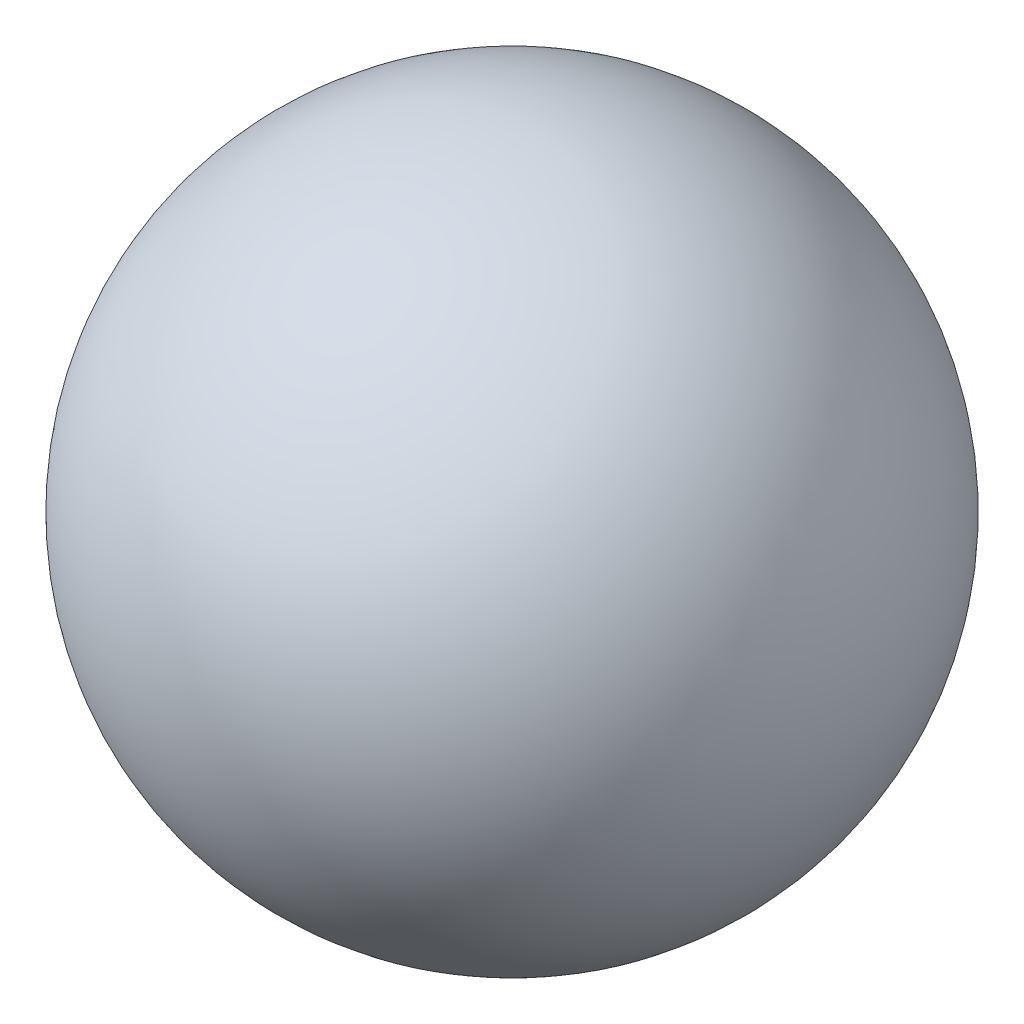
ISO-10303-21;
HEADER;
FILE_DESCRIPTION(('STEP AP214'),'2;1');
FILE_NAME('part.step','',(''),(''),'','','');
FILE_SCHEMA(('AUTOMOTIVE_DESIGN { 1 0 10303 214 1 1 1 1 }'));
ENDSEC;
DATA;
#1=APPLICATION_CONTEXT('core data for automotive mechanical design processes');
#2=APPLICATION_PROTOCOL_DEFINITION('international standard','automotive_design',2000,#1);
#3=PRODUCT_CONTEXT('',#1,'mechanical');
#4=PRODUCT('Part','Part','',(#3));
#5=PRODUCT_RELATED_PRODUCT_CATEGORY('part','',(#4));
#6=PRODUCT_DEFINITION_FORMATION('','',#4);
#7=PRODUCT_DEFINITION_CONTEXT('part definition',#1,'design');
#8=PRODUCT_DEFINITION('design','',#6,#7);
#9=PRODUCT_DEFINITION_SHAPE('','',#8);
#10=(LENGTH_UNIT() NAMED_UNIT(*) SI_UNIT(.MILLI.,.METRE.));
#11=(NAMED_UNIT(*) PLANE_ANGLE_UNIT() SI_UNIT($,.RADIAN.));
#12=(NAMED_UNIT(*) SI_UNIT($,.STERADIAN.) SOLID_ANGLE_UNIT());
#13=UNCERTAINTY_MEASURE_WITH_UNIT(LENGTH_MEASURE(1.E-05),#10,'distance_accuracy_value','');
#14=(GEOMETRIC_REPRESENTATION_CONTEXT(3) GLOBAL_UNCERTAINTY_ASSIGNED_CONTEXT((#13)) GLOBAL_UNIT_ASSIGNED_CONTEXT((#10,
#11,#12)) REPRESENTATION_CONTEXT('',''));
#15=CARTESIAN_POINT('',(0.,0.,0.));
#16=DIRECTION('',(0.,0.,1.));
#17=DIRECTION('',(1.,0.,0.));
#18=AXIS2_PLACEMENT_3D('',#15,#16,#17);
#19=CARTESIAN_POINT('',(0.,0.,0.));
#20=DIRECTION('',(0.,1.,0.));
#21=DIRECTION('',(1.,0.,0.));
#22=AXIS2_PLACEMENT_3D('',#19,#20,#21);
#23=SPHERICAL_SURFACE('',#22,50.);
#24=CARTESIAN_POINT('',(0.,50.,0.));
#25=VERTEX_POINT('',#24);
#26=VERTEX_LOOP('',#25);
#27=FACE_BOUND('',#26,.T.);
#28=ADVANCED_FACE('F29',(#27),#23,.T.);
#29=CLOSED_SHELL('',(#28));
#30=MANIFOLD_SOLID_BREP('B2',#29);
#31=ADVANCED_BREP_SHAPE_REPRESENTATION('',(#18,#30),#14);
#32=SHAPE_DEFINITION_REPRESENTATION(#9,#31);
ENDSEC;
END-ISO-10303-21;
